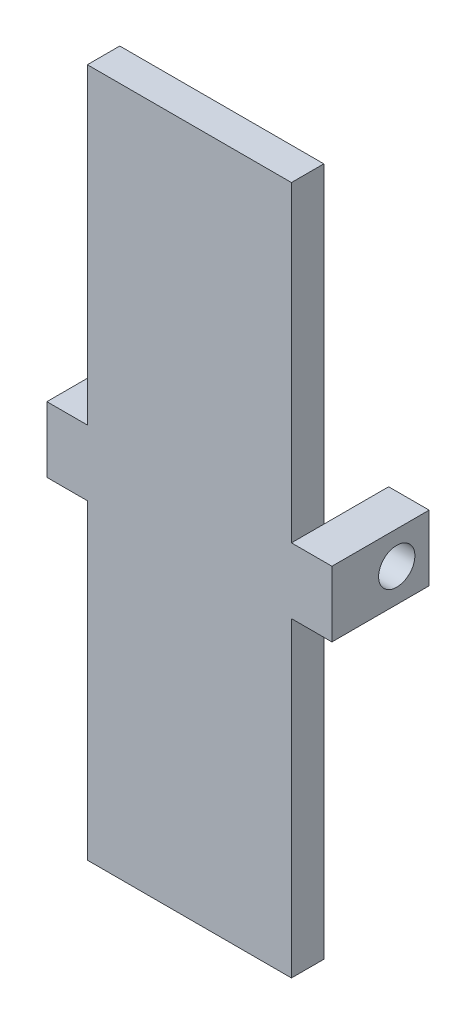
ISO-10303-21;
HEADER;
FILE_DESCRIPTION(('STEP AP214'),'2;1');
FILE_NAME('part.step','',(''),(''),'','','');
FILE_SCHEMA(('AUTOMOTIVE_DESIGN { 1 0 10303 214 1 1 1 1 }'));
ENDSEC;
DATA;
#1=APPLICATION_CONTEXT('core data for automotive mechanical design processes');
#2=APPLICATION_PROTOCOL_DEFINITION('international standard','automotive_design',2000,#1);
#3=PRODUCT_CONTEXT('',#1,'mechanical');
#4=PRODUCT('Part','Part','',(#3));
#5=PRODUCT_RELATED_PRODUCT_CATEGORY('part','',(#4));
#6=PRODUCT_DEFINITION_FORMATION('','',#4);
#7=PRODUCT_DEFINITION_CONTEXT('part definition',#1,'design');
#8=PRODUCT_DEFINITION('design','',#6,#7);
#9=PRODUCT_DEFINITION_SHAPE('','',#8);
#10=(LENGTH_UNIT() NAMED_UNIT(*) SI_UNIT(.MILLI.,.METRE.));
#11=(NAMED_UNIT(*) PLANE_ANGLE_UNIT() SI_UNIT($,.RADIAN.));
#12=(NAMED_UNIT(*) SI_UNIT($,.STERADIAN.) SOLID_ANGLE_UNIT());
#13=UNCERTAINTY_MEASURE_WITH_UNIT(LENGTH_MEASURE(1.E-05),#10,'distance_accuracy_value','');
#14=(GEOMETRIC_REPRESENTATION_CONTEXT(3) GLOBAL_UNCERTAINTY_ASSIGNED_CONTEXT((#13)) GLOBAL_UNIT_ASSIGNED_CONTEXT((#10,
#11,#12)) REPRESENTATION_CONTEXT('',''));
#15=CARTESIAN_POINT('',(0.,0.,0.));
#16=DIRECTION('',(0.,0.,1.));
#17=DIRECTION('',(1.,0.,0.));
#18=AXIS2_PLACEMENT_3D('',#15,#16,#17);
#19=CARTESIAN_POINT('',(-16.,54.0113308317571,2.54));
#20=DIRECTION('',(1.,0.,0.));
#21=DIRECTION('',(0.,1.,0.));
#22=AXIS2_PLACEMENT_3D('',#19,#20,#21);
#23=PLANE('',#22);
#24=DIRECTION('',(0.,-1.,0.));
#25=VECTOR('',#24,1.);
#26=CARTESIAN_POINT('',(-16.,54.0113308317571,2.54));
#27=LINE('',#26,#25);
#28=CARTESIAN_POINT('',(-16.,24.4042120869512,2.54));
#29=VERTEX_POINT('',#28);
#30=CARTESIAN_POINT('',(-16.,0.,2.54));
#31=VERTEX_POINT('',#30);
#32=EDGE_CURVE('E171',#29,#31,#27,.T.);
#33=ORIENTED_EDGE('',*,*,#32,.F.);
#34=DIRECTION('',(0.,0.,-1.));
#35=VECTOR('',#34,1.);
#36=CARTESIAN_POINT('',(-16.,24.4042120869512,2.54));
#37=LINE('',#36,#35);
#38=CARTESIAN_POINT('',(-16.,24.4042120869512,0.));
#39=VERTEX_POINT('',#38);
#40=EDGE_CURVE('E37',#29,#39,#37,.T.);
#41=ORIENTED_EDGE('',*,*,#40,.T.);
#42=DIRECTION('',(0.,-1.,0.));
#43=VECTOR('',#42,1.);
#44=CARTESIAN_POINT('',(-16.,54.0113308317571,0.));
#45=LINE('',#44,#43);
#46=CARTESIAN_POINT('',(-16.,0.,0.));
#47=VERTEX_POINT('',#46);
#48=EDGE_CURVE('E241',#39,#47,#45,.T.);
#49=ORIENTED_EDGE('',*,*,#48,.T.);
#50=DIRECTION('',(0.,0.,-1.));
#51=VECTOR('',#50,1.);
#52=CARTESIAN_POINT('',(-16.,0.,2.54));
#53=LINE('',#52,#51);
#54=EDGE_CURVE('E250',#31,#47,#53,.T.);
#55=ORIENTED_EDGE('',*,*,#54,.F.);
#56=EDGE_LOOP('',(#33,#41,#49,#55));
#57=FACE_BOUND('',#56,.T.);
#58=ADVANCED_FACE('F33',(#57),#23,.F.);
#59=CARTESIAN_POINT('',(0.,54.0113308317571,2.54));
#60=DIRECTION('',(-1.,0.,0.));
#61=DIRECTION('',(0.,-1.,0.));
#62=AXIS2_PLACEMENT_3D('',#59,#60,#61);
#63=PLANE('',#62);
#64=DIRECTION('',(0.,0.,1.));
#65=VECTOR('',#64,1.);
#66=CARTESIAN_POINT('',(0.,29.5456654158786,-5.08));
#67=LINE('',#66,#65);
#68=CARTESIAN_POINT('',(0.,29.5456654158786,0.));
#69=VERTEX_POINT('',#68);
#70=CARTESIAN_POINT('',(0.,29.5456654158786,2.54));
#71=VERTEX_POINT('',#70);
#72=EDGE_CURVE('E43',#69,#71,#67,.T.);
#73=ORIENTED_EDGE('',*,*,#72,.F.);
#74=DIRECTION('',(0.,1.,0.));
#75=VECTOR('',#74,1.);
#76=CARTESIAN_POINT('',(0.,54.0113308317571,0.));
#77=LINE('',#76,#75);
#78=CARTESIAN_POINT('',(0.,54.0113308317571,0.));
#79=VERTEX_POINT('',#78);
#80=EDGE_CURVE('E219',#69,#79,#77,.T.);
#81=ORIENTED_EDGE('',*,*,#80,.T.);
#82=DIRECTION('',(0.,0.,-1.));
#83=VECTOR('',#82,1.);
#84=CARTESIAN_POINT('',(0.,54.0113308317571,2.54));
#85=LINE('',#84,#83);
#86=CARTESIAN_POINT('',(0.,54.0113308317571,2.54));
#87=VERTEX_POINT('',#86);
#88=EDGE_CURVE('E256',#87,#79,#85,.T.);
#89=ORIENTED_EDGE('',*,*,#88,.F.);
#90=DIRECTION('',(0.,1.,0.));
#91=VECTOR('',#90,1.);
#92=CARTESIAN_POINT('',(0.,54.0113308317571,2.54));
#93=LINE('',#92,#91);
#94=EDGE_CURVE('E58',#71,#87,#93,.T.);
#95=ORIENTED_EDGE('',*,*,#94,.F.);
#96=EDGE_LOOP('',(#73,#81,#89,#95));
#97=FACE_BOUND('',#96,.T.);
#98=ADVANCED_FACE('F35',(#97),#63,.F.);
#99=DIRECTION('',(0.,0.,-1.));
#100=VECTOR('',#99,1.);
#101=CARTESIAN_POINT('',(0.,24.4042120869512,2.54));
#102=LINE('',#101,#100);
#103=CARTESIAN_POINT('',(0.,24.4042120869512,2.54));
#104=VERTEX_POINT('',#103);
#105=CARTESIAN_POINT('',(0.,24.4042120869512,0.));
#106=VERTEX_POINT('',#105);
#107=EDGE_CURVE('E208',#104,#106,#102,.T.);
#108=ORIENTED_EDGE('',*,*,#107,.F.);
#109=CARTESIAN_POINT('',(0.,0.,2.54));
#110=VERTEX_POINT('',#109);
#111=EDGE_CURVE('E259',#110,#104,#93,.T.);
#112=ORIENTED_EDGE('',*,*,#111,.F.);
#113=DIRECTION('',(0.,0.,-1.));
#114=VECTOR('',#113,1.);
#115=CARTESIAN_POINT('',(0.,0.,2.54));
#116=LINE('',#115,#114);
#117=CARTESIAN_POINT('',(0.,0.,0.));
#118=VERTEX_POINT('',#117);
#119=EDGE_CURVE('E235',#110,#118,#116,.T.);
#120=ORIENTED_EDGE('',*,*,#119,.T.);
#121=EDGE_CURVE('E236',#118,#106,#77,.T.);
#122=ORIENTED_EDGE('',*,*,#121,.T.);
#123=EDGE_LOOP('',(#108,#112,#120,#122));
#124=FACE_BOUND('',#123,.T.);
#125=ADVANCED_FACE('F307',(#124),#63,.F.);
#126=CARTESIAN_POINT('',(0.,54.0113308317571,2.54));
#127=DIRECTION('',(0.,-1.,0.));
#128=DIRECTION('',(0.,0.,-1.));
#129=AXIS2_PLACEMENT_3D('',#126,#127,#128);
#130=PLANE('',#129);
#131=DIRECTION('',(-1.,0.,0.));
#132=VECTOR('',#131,1.);
#133=CARTESIAN_POINT('',(0.,54.0113308317571,0.));
#134=LINE('',#133,#132);
#135=CARTESIAN_POINT('',(-16.,54.0113308317571,0.));
#136=VERTEX_POINT('',#135);
#137=EDGE_CURVE('E238',#79,#136,#134,.T.);
#138=ORIENTED_EDGE('',*,*,#137,.T.);
#139=DIRECTION('',(0.,0.,-1.));
#140=VECTOR('',#139,1.);
#141=CARTESIAN_POINT('',(-16.,54.0113308317571,2.54));
#142=LINE('',#141,#140);
#143=CARTESIAN_POINT('',(-16.,54.0113308317571,2.54));
#144=VERTEX_POINT('',#143);
#145=EDGE_CURVE('E253',#144,#136,#142,.T.);
#146=ORIENTED_EDGE('',*,*,#145,.F.);
#147=DIRECTION('',(-1.,0.,0.));
#148=VECTOR('',#147,1.);
#149=CARTESIAN_POINT('',(0.,54.0113308317571,2.54));
#150=LINE('',#149,#148);
#151=EDGE_CURVE('E231',#87,#144,#150,.T.);
#152=ORIENTED_EDGE('',*,*,#151,.F.);
#153=ORIENTED_EDGE('',*,*,#88,.T.);
#154=EDGE_LOOP('',(#138,#146,#152,#153));
#155=FACE_BOUND('',#154,.T.);
#156=ADVANCED_FACE('F294',(#155),#130,.F.);
#157=CARTESIAN_POINT('',(-16.,29.5456654158786,0.));
#158=VERTEX_POINT('',#157);
#159=EDGE_CURVE('E242',#136,#158,#45,.T.);
#160=ORIENTED_EDGE('',*,*,#159,.T.);
#161=DIRECTION('',(0.,0.,1.));
#162=VECTOR('',#161,1.);
#163=CARTESIAN_POINT('',(-16.,29.5456654158786,-5.08));
#164=LINE('',#163,#162);
#165=CARTESIAN_POINT('',(-16.,29.5456654158786,2.54));
#166=VERTEX_POINT('',#165);
#167=EDGE_CURVE('E11',#158,#166,#164,.T.);
#168=ORIENTED_EDGE('',*,*,#167,.T.);
#169=EDGE_CURVE('E142',#144,#166,#27,.T.);
#170=ORIENTED_EDGE('',*,*,#169,.F.);
#171=ORIENTED_EDGE('',*,*,#145,.T.);
#172=EDGE_LOOP('',(#160,#168,#170,#171));
#173=FACE_BOUND('',#172,.T.);
#174=ADVANCED_FACE('F335',(#173),#23,.F.);
#175=CARTESIAN_POINT('',(0.,0.,2.54));
#176=DIRECTION('',(0.,1.,0.));
#177=DIRECTION('',(-1.,0.,0.));
#178=AXIS2_PLACEMENT_3D('',#175,#176,#177);
#179=PLANE('',#178);
#180=DIRECTION('',(1.,0.,0.));
#181=VECTOR('',#180,1.);
#182=CARTESIAN_POINT('',(0.,0.,0.));
#183=LINE('',#182,#181);
#184=EDGE_CURVE('E245',#47,#118,#183,.T.);
#185=ORIENTED_EDGE('',*,*,#184,.T.);
#186=ORIENTED_EDGE('',*,*,#119,.F.);
#187=DIRECTION('',(1.,0.,0.));
#188=VECTOR('',#187,1.);
#189=CARTESIAN_POINT('',(0.,0.,2.54));
#190=LINE('',#189,#188);
#191=EDGE_CURVE('E227',#31,#110,#190,.T.);
#192=ORIENTED_EDGE('',*,*,#191,.F.);
#193=ORIENTED_EDGE('',*,*,#54,.T.);
#194=EDGE_LOOP('',(#185,#186,#192,#193));
#195=FACE_BOUND('',#194,.T.);
#196=ADVANCED_FACE('F304',(#195),#179,.F.);
#197=CARTESIAN_POINT('',(0.,0.,2.54));
#198=DIRECTION('',(0.,0.,-1.));
#199=DIRECTION('',(-1.,0.,0.));
#200=AXIS2_PLACEMENT_3D('',#197,#198,#199);
#201=PLANE('',#200);
#202=ORIENTED_EDGE('',*,*,#111,.T.);
#203=DIRECTION('',(-1.,0.,0.));
#204=VECTOR('',#203,1.);
#205=CARTESIAN_POINT('',(3.175,24.4042120869512,2.54));
#206=LINE('',#205,#204);
#207=CARTESIAN_POINT('',(3.175,24.4042120869512,2.54));
#208=VERTEX_POINT('',#207);
#209=EDGE_CURVE('E216',#208,#104,#206,.T.);
#210=ORIENTED_EDGE('',*,*,#209,.F.);
#211=DIRECTION('',(0.,-1.,0.));
#212=VECTOR('',#211,1.);
#213=CARTESIAN_POINT('',(3.175,29.5456654158786,2.54));
#214=LINE('',#213,#212);
#215=CARTESIAN_POINT('',(3.175,29.5456654158786,2.54));
#216=VERTEX_POINT('',#215);
#217=EDGE_CURVE('E195',#216,#208,#214,.T.);
#218=ORIENTED_EDGE('',*,*,#217,.F.);
#219=DIRECTION('',(-1.,0.,0.));
#220=VECTOR('',#219,1.);
#221=CARTESIAN_POINT('',(3.175,29.5456654158786,2.54));
#222=LINE('',#221,#220);
#223=EDGE_CURVE('E205',#216,#71,#222,.T.);
#224=ORIENTED_EDGE('',*,*,#223,.T.);
#225=ORIENTED_EDGE('',*,*,#94,.T.);
#226=ORIENTED_EDGE('',*,*,#151,.T.);
#227=ORIENTED_EDGE('',*,*,#169,.T.);
#228=DIRECTION('',(1.,0.,0.));
#229=VECTOR('',#228,1.);
#230=CARTESIAN_POINT('',(-19.175,29.5456654158786,2.54));
#231=LINE('',#230,#229);
#232=CARTESIAN_POINT('',(-19.175,29.5456654158786,2.54));
#233=VERTEX_POINT('',#232);
#234=EDGE_CURVE('E51',#233,#166,#231,.T.);
#235=ORIENTED_EDGE('',*,*,#234,.F.);
#236=DIRECTION('',(0.,-1.,0.));
#237=VECTOR('',#236,1.);
#238=CARTESIAN_POINT('',(-19.175,29.5456654158786,2.54));
#239=LINE('',#238,#237);
#240=CARTESIAN_POINT('',(-19.175,24.4042120869512,2.54));
#241=VERTEX_POINT('',#240);
#242=EDGE_CURVE('E139',#233,#241,#239,.T.);
#243=ORIENTED_EDGE('',*,*,#242,.T.);
#244=DIRECTION('',(1.,0.,0.));
#245=VECTOR('',#244,1.);
#246=CARTESIAN_POINT('',(-19.175,24.4042120869512,2.54));
#247=LINE('',#246,#245);
#248=EDGE_CURVE('E163',#241,#29,#247,.T.);
#249=ORIENTED_EDGE('',*,*,#248,.T.);
#250=ORIENTED_EDGE('',*,*,#32,.T.);
#251=ORIENTED_EDGE('',*,*,#191,.T.);
#252=EDGE_LOOP('',(#202,#210,#218,#224,#225,#226,#227,#235,#243,#249,#250,#251));
#253=FACE_BOUND('',#252,.T.);
#254=ADVANCED_FACE('F138',(#253),#201,.F.);
#255=CARTESIAN_POINT('',(0.,0.,0.));
#256=DIRECTION('',(0.,0.,-1.));
#257=DIRECTION('',(-1.,0.,0.));
#258=AXIS2_PLACEMENT_3D('',#255,#256,#257);
#259=PLANE('',#258);
#260=ORIENTED_EDGE('',*,*,#121,.F.);
#261=ORIENTED_EDGE('',*,*,#184,.F.);
#262=ORIENTED_EDGE('',*,*,#48,.F.);
#263=EDGE_CURVE('E246',#158,#39,#45,.T.);
#264=ORIENTED_EDGE('',*,*,#263,.F.);
#265=ORIENTED_EDGE('',*,*,#159,.F.);
#266=ORIENTED_EDGE('',*,*,#137,.F.);
#267=ORIENTED_EDGE('',*,*,#80,.F.);
#268=EDGE_CURVE('E239',#106,#69,#77,.T.);
#269=ORIENTED_EDGE('',*,*,#268,.F.);
#270=EDGE_LOOP('',(#260,#261,#262,#264,#265,#266,#267,#269));
#271=FACE_BOUND('',#270,.T.);
#272=ADVANCED_FACE('F289',(#271),#259,.T.);
#273=CARTESIAN_POINT('',(0.,0.,0.));
#274=DIRECTION('',(1.,0.,0.));
#275=DIRECTION('',(0.,0.,-1.));
#276=AXIS2_PLACEMENT_3D('',#273,#274,#275);
#277=PLANE('',#276);
#278=CARTESIAN_POINT('',(0.,27.0056654158786,-2.54));
#279=DIRECTION('',(1.,0.,0.));
#280=DIRECTION('',(0.,0.,-1.));
#281=AXIS2_PLACEMENT_3D('',#278,#279,#280);
#282=CIRCLE('',#281,1.4224);
#283=CARTESIAN_POINT('',(0.,27.0056654158786,-3.9624));
#284=VERTEX_POINT('',#283);
#285=EDGE_CURVE('E143',#284,#284,#282,.T.);
#286=ORIENTED_EDGE('',*,*,#285,.T.);
#287=EDGE_LOOP('',(#286));
#288=FACE_BOUND('',#287,.T.);
#289=CARTESIAN_POINT('',(0.,24.4042120869512,-5.08));
#290=VERTEX_POINT('',#289);
#291=EDGE_CURVE('E192',#106,#290,#102,.T.);
#292=ORIENTED_EDGE('',*,*,#291,.F.);
#293=ORIENTED_EDGE('',*,*,#268,.T.);
#294=CARTESIAN_POINT('',(0.,29.5456654158786,-5.08));
#295=VERTEX_POINT('',#294);
#296=EDGE_CURVE('E199',#295,#69,#67,.T.);
#297=ORIENTED_EDGE('',*,*,#296,.F.);
#298=DIRECTION('',(0.,1.,0.));
#299=VECTOR('',#298,1.);
#300=CARTESIAN_POINT('',(0.,24.4042120869512,-5.08));
#301=LINE('',#300,#299);
#302=EDGE_CURVE('E209',#290,#295,#301,.T.);
#303=ORIENTED_EDGE('',*,*,#302,.F.);
#304=EDGE_LOOP('',(#292,#293,#297,#303));
#305=FACE_BOUND('',#304,.T.);
#306=ADVANCED_FACE('F282',(#288,#305),#277,.F.);
#307=CARTESIAN_POINT('',(3.175,0.,0.));
#308=DIRECTION('',(1.,0.,0.));
#309=DIRECTION('',(0.,0.,-1.));
#310=AXIS2_PLACEMENT_3D('',#307,#308,#309);
#311=PLANE('',#310);
#312=ORIENTED_EDGE('',*,*,#217,.T.);
#313=DIRECTION('',(0.,0.,-1.));
#314=VECTOR('',#313,1.);
#315=CARTESIAN_POINT('',(3.175,24.4042120869512,2.54));
#316=LINE('',#315,#314);
#317=CARTESIAN_POINT('',(3.175,24.4042120869512,-5.08));
#318=VERTEX_POINT('',#317);
#319=EDGE_CURVE('E198',#208,#318,#316,.T.);
#320=ORIENTED_EDGE('',*,*,#319,.T.);
#321=DIRECTION('',(0.,1.,0.));
#322=VECTOR('',#321,1.);
#323=CARTESIAN_POINT('',(3.175,24.4042120869512,-5.08));
#324=LINE('',#323,#322);
#325=CARTESIAN_POINT('',(3.175,29.5456654158786,-5.08));
#326=VERTEX_POINT('',#325);
#327=EDGE_CURVE('E201',#318,#326,#324,.T.);
#328=ORIENTED_EDGE('',*,*,#327,.T.);
#329=DIRECTION('',(0.,0.,1.));
#330=VECTOR('',#329,1.);
#331=CARTESIAN_POINT('',(3.175,29.5456654158786,-5.08));
#332=LINE('',#331,#330);
#333=EDGE_CURVE('E203',#326,#216,#332,.T.);
#334=ORIENTED_EDGE('',*,*,#333,.T.);
#335=EDGE_LOOP('',(#312,#320,#328,#334));
#336=FACE_BOUND('',#335,.T.);
#337=CARTESIAN_POINT('',(3.175,27.0056654158786,-2.54));
#338=DIRECTION('',(1.,0.,0.));
#339=DIRECTION('',(0.,0.,-1.));
#340=AXIS2_PLACEMENT_3D('',#337,#338,#339);
#341=CIRCLE('',#340,1.4224);
#342=CARTESIAN_POINT('',(3.175,27.0056654158786,-3.9624));
#343=VERTEX_POINT('',#342);
#344=EDGE_CURVE('E189',#343,#343,#341,.T.);
#345=ORIENTED_EDGE('',*,*,#344,.F.);
#346=EDGE_LOOP('',(#345));
#347=FACE_BOUND('',#346,.T.);
#348=ADVANCED_FACE('F313',(#336,#347),#311,.T.);
#349=CARTESIAN_POINT('',(3.175,24.4042120869512,2.54));
#350=DIRECTION('',(0.,1.,0.));
#351=DIRECTION('',(0.,0.,1.));
#352=AXIS2_PLACEMENT_3D('',#349,#350,#351);
#353=PLANE('',#352);
#354=ORIENTED_EDGE('',*,*,#107,.T.);
#355=ORIENTED_EDGE('',*,*,#291,.T.);
#356=DIRECTION('',(-1.,0.,0.));
#357=VECTOR('',#356,1.);
#358=CARTESIAN_POINT('',(3.175,24.4042120869512,-5.08));
#359=LINE('',#358,#357);
#360=EDGE_CURVE('E220',#318,#290,#359,.T.);
#361=ORIENTED_EDGE('',*,*,#360,.F.);
#362=ORIENTED_EDGE('',*,*,#319,.F.);
#363=ORIENTED_EDGE('',*,*,#209,.T.);
#364=EDGE_LOOP('',(#354,#355,#361,#362,#363));
#365=FACE_BOUND('',#364,.T.);
#366=ADVANCED_FACE('F311',(#365),#353,.F.);
#367=CARTESIAN_POINT('',(3.175,24.4042120869512,-5.08));
#368=DIRECTION('',(0.,0.,1.));
#369=DIRECTION('',(1.,0.,0.));
#370=AXIS2_PLACEMENT_3D('',#367,#368,#369);
#371=PLANE('',#370);
#372=ORIENTED_EDGE('',*,*,#302,.T.);
#373=DIRECTION('',(-1.,0.,0.));
#374=VECTOR('',#373,1.);
#375=CARTESIAN_POINT('',(3.175,29.5456654158786,-5.08));
#376=LINE('',#375,#374);
#377=EDGE_CURVE('E225',#326,#295,#376,.T.);
#378=ORIENTED_EDGE('',*,*,#377,.F.);
#379=ORIENTED_EDGE('',*,*,#327,.F.);
#380=ORIENTED_EDGE('',*,*,#360,.T.);
#381=EDGE_LOOP('',(#372,#378,#379,#380));
#382=FACE_BOUND('',#381,.T.);
#383=ADVANCED_FACE('F273',(#382),#371,.F.);
#384=CARTESIAN_POINT('',(3.175,29.5456654158786,-5.08));
#385=DIRECTION('',(0.,-1.,0.));
#386=DIRECTION('',(0.,0.,-1.));
#387=AXIS2_PLACEMENT_3D('',#384,#385,#386);
#388=PLANE('',#387);
#389=ORIENTED_EDGE('',*,*,#296,.T.);
#390=ORIENTED_EDGE('',*,*,#72,.T.);
#391=ORIENTED_EDGE('',*,*,#223,.F.);
#392=ORIENTED_EDGE('',*,*,#333,.F.);
#393=ORIENTED_EDGE('',*,*,#377,.T.);
#394=EDGE_LOOP('',(#389,#390,#391,#392,#393));
#395=FACE_BOUND('',#394,.T.);
#396=ADVANCED_FACE('F279',(#395),#388,.F.);
#397=CARTESIAN_POINT('',(3.175,27.0056654158786,-2.54));
#398=DIRECTION('',(-1.,0.,0.));
#399=DIRECTION('',(0.,0.,1.));
#400=AXIS2_PLACEMENT_3D('',#397,#398,#399);
#401=CYLINDRICAL_SURFACE('',#400,1.4224);
#402=ORIENTED_EDGE('',*,*,#344,.T.);
#403=EDGE_LOOP('',(#402));
#404=FACE_BOUND('',#403,.T.);
#405=ORIENTED_EDGE('',*,*,#285,.F.);
#406=EDGE_LOOP('',(#405));
#407=FACE_BOUND('',#406,.T.);
#408=ADVANCED_FACE('F319',(#404,#407),#401,.F.);
#409=CARTESIAN_POINT('',(-16.,0.,0.));
#410=DIRECTION('',(-1.,0.,0.));
#411=DIRECTION('',(0.,0.,-1.));
#412=AXIS2_PLACEMENT_3D('',#409,#410,#411);
#413=PLANE('',#412);
#414=CARTESIAN_POINT('',(-16.,27.0056654158786,-2.54));
#415=DIRECTION('',(1.,0.,0.));
#416=DIRECTION('',(0.,0.,-1.));
#417=AXIS2_PLACEMENT_3D('',#414,#415,#416);
#418=CIRCLE('',#417,1.4224);
#419=CARTESIAN_POINT('',(-16.,27.0056654158786,-3.9624));
#420=VERTEX_POINT('',#419);
#421=EDGE_CURVE('E372',#420,#420,#418,.T.);
#422=ORIENTED_EDGE('',*,*,#421,.F.);
#423=EDGE_LOOP('',(#422));
#424=FACE_BOUND('',#423,.T.);
#425=CARTESIAN_POINT('',(-16.,29.5456654158786,-5.08));
#426=VERTEX_POINT('',#425);
#427=EDGE_CURVE('E164',#426,#158,#164,.T.);
#428=ORIENTED_EDGE('',*,*,#427,.T.);
#429=ORIENTED_EDGE('',*,*,#263,.T.);
#430=CARTESIAN_POINT('',(-16.,24.4042120869512,-5.08));
#431=VERTEX_POINT('',#430);
#432=EDGE_CURVE('E186',#39,#431,#37,.T.);
#433=ORIENTED_EDGE('',*,*,#432,.T.);
#434=DIRECTION('',(0.,1.,0.));
#435=VECTOR('',#434,1.);
#436=CARTESIAN_POINT('',(-16.,24.4042120869512,-5.08));
#437=LINE('',#436,#435);
#438=EDGE_CURVE('E168',#431,#426,#437,.T.);
#439=ORIENTED_EDGE('',*,*,#438,.T.);
#440=EDGE_LOOP('',(#428,#429,#433,#439));
#441=FACE_BOUND('',#440,.T.);
#442=ADVANCED_FACE('F322',(#424,#441),#413,.F.);
#443=CARTESIAN_POINT('',(-19.175,29.5456654158786,-5.08));
#444=DIRECTION('',(0.,1.,0.));
#445=DIRECTION('',(0.,0.,1.));
#446=AXIS2_PLACEMENT_3D('',#443,#444,#445);
#447=PLANE('',#446);
#448=ORIENTED_EDGE('',*,*,#427,.F.);
#449=DIRECTION('',(1.,0.,0.));
#450=VECTOR('',#449,1.);
#451=CARTESIAN_POINT('',(-19.175,29.5456654158786,-5.08));
#452=LINE('',#451,#450);
#453=CARTESIAN_POINT('',(-19.175,29.5456654158786,-5.08));
#454=VERTEX_POINT('',#453);
#455=EDGE_CURVE('E144',#454,#426,#452,.T.);
#456=ORIENTED_EDGE('',*,*,#455,.F.);
#457=DIRECTION('',(0.,0.,1.));
#458=VECTOR('',#457,1.);
#459=CARTESIAN_POINT('',(-19.175,29.5456654158786,-5.08));
#460=LINE('',#459,#458);
#461=EDGE_CURVE('E150',#454,#233,#460,.T.);
#462=ORIENTED_EDGE('',*,*,#461,.T.);
#463=ORIENTED_EDGE('',*,*,#234,.T.);
#464=ORIENTED_EDGE('',*,*,#167,.F.);
#465=EDGE_LOOP('',(#448,#456,#462,#463,#464));
#466=FACE_BOUND('',#465,.T.);
#467=ADVANCED_FACE('F156',(#466),#447,.T.);
#468=CARTESIAN_POINT('',(-19.175,24.4042120869512,-5.08));
#469=DIRECTION('',(0.,0.,-1.));
#470=DIRECTION('',(-1.,0.,0.));
#471=AXIS2_PLACEMENT_3D('',#468,#469,#470);
#472=PLANE('',#471);
#473=ORIENTED_EDGE('',*,*,#438,.F.);
#474=DIRECTION('',(1.,0.,0.));
#475=VECTOR('',#474,1.);
#476=CARTESIAN_POINT('',(-19.175,24.4042120869512,-5.08));
#477=LINE('',#476,#475);
#478=CARTESIAN_POINT('',(-19.175,24.4042120869512,-5.08));
#479=VERTEX_POINT('',#478);
#480=EDGE_CURVE('E177',#479,#431,#477,.T.);
#481=ORIENTED_EDGE('',*,*,#480,.F.);
#482=DIRECTION('',(0.,1.,0.));
#483=VECTOR('',#482,1.);
#484=CARTESIAN_POINT('',(-19.175,24.4042120869512,-5.08));
#485=LINE('',#484,#483);
#486=EDGE_CURVE('E157',#479,#454,#485,.T.);
#487=ORIENTED_EDGE('',*,*,#486,.T.);
#488=ORIENTED_EDGE('',*,*,#455,.T.);
#489=EDGE_LOOP('',(#473,#481,#487,#488));
#490=FACE_BOUND('',#489,.T.);
#491=ADVANCED_FACE('F351',(#490),#472,.T.);
#492=CARTESIAN_POINT('',(-19.175,24.4042120869512,2.54));
#493=DIRECTION('',(0.,-1.,0.));
#494=DIRECTION('',(0.,0.,-1.));
#495=AXIS2_PLACEMENT_3D('',#492,#493,#494);
#496=PLANE('',#495);
#497=ORIENTED_EDGE('',*,*,#40,.F.);
#498=ORIENTED_EDGE('',*,*,#248,.F.);
#499=DIRECTION('',(0.,0.,-1.));
#500=VECTOR('',#499,1.);
#501=CARTESIAN_POINT('',(-19.175,24.4042120869512,2.54));
#502=LINE('',#501,#500);
#503=EDGE_CURVE('E153',#241,#479,#502,.T.);
#504=ORIENTED_EDGE('',*,*,#503,.T.);
#505=ORIENTED_EDGE('',*,*,#480,.T.);
#506=ORIENTED_EDGE('',*,*,#432,.F.);
#507=EDGE_LOOP('',(#497,#498,#504,#505,#506));
#508=FACE_BOUND('',#507,.T.);
#509=ADVANCED_FACE('F349',(#508),#496,.T.);
#510=CARTESIAN_POINT('',(-19.175,0.,0.));
#511=DIRECTION('',(-1.,0.,0.));
#512=DIRECTION('',(0.,0.,-1.));
#513=AXIS2_PLACEMENT_3D('',#510,#511,#512);
#514=PLANE('',#513);
#515=CARTESIAN_POINT('',(-19.175,27.0056654158786,-2.54));
#516=DIRECTION('',(1.,0.,0.));
#517=DIRECTION('',(0.,0.,-1.));
#518=AXIS2_PLACEMENT_3D('',#515,#516,#517);
#519=CIRCLE('',#518,1.4224);
#520=CARTESIAN_POINT('',(-19.175,27.0056654158786,-3.9624));
#521=VERTEX_POINT('',#520);
#522=EDGE_CURVE('E169',#521,#521,#519,.T.);
#523=ORIENTED_EDGE('',*,*,#522,.T.);
#524=EDGE_LOOP('',(#523));
#525=FACE_BOUND('',#524,.T.);
#526=ORIENTED_EDGE('',*,*,#242,.F.);
#527=ORIENTED_EDGE('',*,*,#461,.F.);
#528=ORIENTED_EDGE('',*,*,#486,.F.);
#529=ORIENTED_EDGE('',*,*,#503,.F.);
#530=EDGE_LOOP('',(#526,#527,#528,#529));
#531=FACE_BOUND('',#530,.T.);
#532=ADVANCED_FACE('F148',(#525,#531),#514,.T.);
#533=CARTESIAN_POINT('',(-19.175,27.0056654158786,-2.54));
#534=DIRECTION('',(1.,0.,0.));
#535=DIRECTION('',(0.,0.,-1.));
#536=AXIS2_PLACEMENT_3D('',#533,#534,#535);
#537=CYLINDRICAL_SURFACE('',#536,1.4224);
#538=ORIENTED_EDGE('',*,*,#522,.F.);
#539=EDGE_LOOP('',(#538));
#540=FACE_BOUND('',#539,.T.);
#541=ORIENTED_EDGE('',*,*,#421,.T.);
#542=EDGE_LOOP('',(#541));
#543=FACE_BOUND('',#542,.T.);
#544=ADVANCED_FACE('F357',(#540,#543),#537,.F.);
#545=CLOSED_SHELL('',(#58,#98,#125,#156,#174,#196,#254,#272,#306,#348,#366,#383,#396,#408,#442,
#467,#491,#509,#532,#544));
#546=MANIFOLD_SOLID_BREP('B2',#545);
#547=ADVANCED_BREP_SHAPE_REPRESENTATION('',(#18,#546),#14);
#548=SHAPE_DEFINITION_REPRESENTATION(#9,#547);
ENDSEC;
END-ISO-10303-21;
